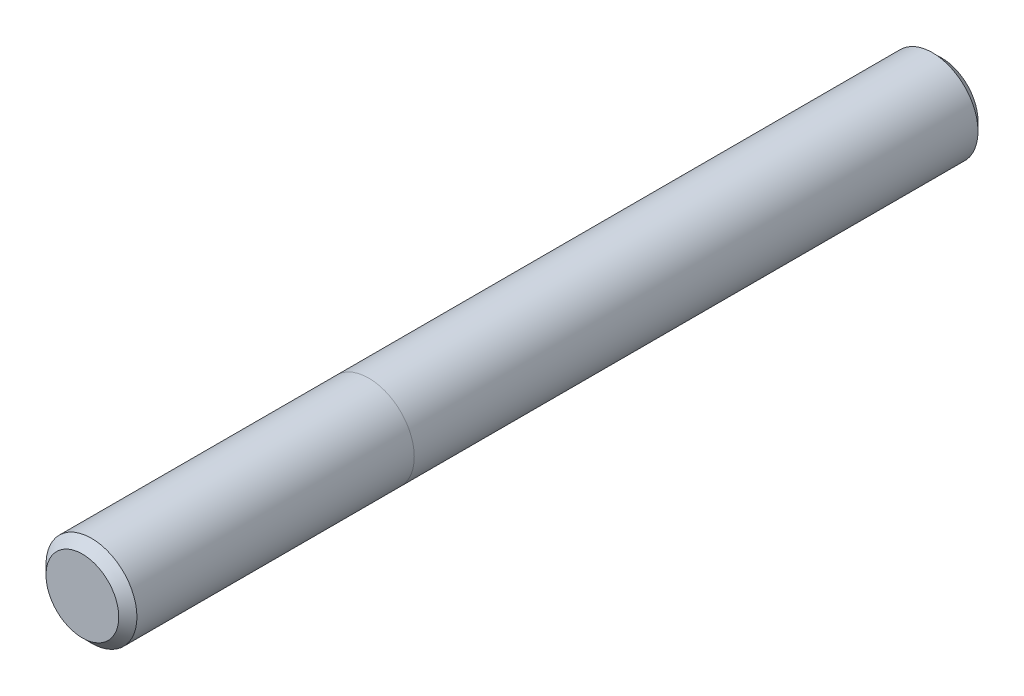
ISO-10303-21;
HEADER;
FILE_DESCRIPTION(('STEP AP214'),'2;1');
FILE_NAME('part.step','',(''),(''),'','','');
FILE_SCHEMA(('AUTOMOTIVE_DESIGN { 1 0 10303 214 1 1 1 1 }'));
ENDSEC;
DATA;
#1=APPLICATION_CONTEXT('core data for automotive mechanical design processes');
#2=APPLICATION_PROTOCOL_DEFINITION('international standard','automotive_design',2000,#1);
#3=PRODUCT_CONTEXT('',#1,'mechanical');
#4=PRODUCT('Part','Part','',(#3));
#5=PRODUCT_RELATED_PRODUCT_CATEGORY('part','',(#4));
#6=PRODUCT_DEFINITION_FORMATION('','',#4);
#7=PRODUCT_DEFINITION_CONTEXT('part definition',#1,'design');
#8=PRODUCT_DEFINITION('design','',#6,#7);
#9=PRODUCT_DEFINITION_SHAPE('','',#8);
#10=(LENGTH_UNIT() NAMED_UNIT(*) SI_UNIT(.MILLI.,.METRE.));
#11=(NAMED_UNIT(*) PLANE_ANGLE_UNIT() SI_UNIT($,.RADIAN.));
#12=(NAMED_UNIT(*) SI_UNIT($,.STERADIAN.) SOLID_ANGLE_UNIT());
#13=UNCERTAINTY_MEASURE_WITH_UNIT(LENGTH_MEASURE(1.E-05),#10,'distance_accuracy_value','');
#14=(GEOMETRIC_REPRESENTATION_CONTEXT(3) GLOBAL_UNCERTAINTY_ASSIGNED_CONTEXT((#13)) GLOBAL_UNIT_ASSIGNED_CONTEXT((#10,
#11,#12)) REPRESENTATION_CONTEXT('',''));
#15=CARTESIAN_POINT('',(0.,0.,0.));
#16=DIRECTION('',(0.,0.,1.));
#17=DIRECTION('',(1.,0.,0.));
#18=AXIS2_PLACEMENT_3D('',#15,#16,#17);
#19=CARTESIAN_POINT('',(0.,0.,75.));
#20=DIRECTION('',(0.,0.,-1.));
#21=DIRECTION('',(-1.,0.,0.));
#22=AXIS2_PLACEMENT_3D('',#19,#20,#21);
#23=CYLINDRICAL_SURFACE('',#22,7.9375);
#24=CARTESIAN_POINT('',(0.,0.,73.4125));
#25=DIRECTION('',(0.,0.,1.));
#26=DIRECTION('',(1.,0.,0.));
#27=AXIS2_PLACEMENT_3D('',#24,#25,#26);
#28=CIRCLE('',#27,7.9375);
#29=CARTESIAN_POINT('',(7.9375,0.,73.4125));
#30=VERTEX_POINT('',#29);
#31=EDGE_CURVE('E83',#30,#30,#28,.F.);
#32=ORIENTED_EDGE('',*,*,#31,.T.);
#33=EDGE_LOOP('',(#32));
#34=FACE_BOUND('',#33,.T.);
#35=CARTESIAN_POINT('',(0.,0.,25.));
#36=DIRECTION('',(0.,0.,-1.));
#37=DIRECTION('',(-1.,0.,0.));
#38=AXIS2_PLACEMENT_3D('',#35,#36,#37);
#39=CIRCLE('',#38,7.9375);
#40=CARTESIAN_POINT('',(-7.9375,0.,25.));
#41=VERTEX_POINT('',#40);
#42=CARTESIAN_POINT('',(7.9375,0.,25.));
#43=VERTEX_POINT('',#42);
#44=EDGE_CURVE('E11',#41,#43,#39,.T.);
#45=ORIENTED_EDGE('',*,*,#44,.F.);
#46=EDGE_CURVE('E53',#43,#41,#39,.T.);
#47=ORIENTED_EDGE('',*,*,#46,.F.);
#48=EDGE_LOOP('',(#45,#47));
#49=FACE_BOUND('',#48,.T.);
#50=ADVANCED_FACE('F49',(#34,#49),#23,.T.);
#51=ORIENTED_EDGE('',*,*,#46,.T.);
#52=ORIENTED_EDGE('',*,*,#44,.T.);
#53=EDGE_LOOP('',(#51,#52));
#54=FACE_BOUND('',#53,.T.);
#55=CARTESIAN_POINT('',(0.,0.,-73.4125));
#56=DIRECTION('',(0.,0.,1.));
#57=DIRECTION('',(1.,0.,0.));
#58=AXIS2_PLACEMENT_3D('',#55,#56,#57);
#59=CIRCLE('',#58,7.9375);
#60=CARTESIAN_POINT('',(7.9375,0.,-73.4125));
#61=VERTEX_POINT('',#60);
#62=EDGE_CURVE('E77',#61,#61,#59,.T.);
#63=ORIENTED_EDGE('',*,*,#62,.T.);
#64=EDGE_LOOP('',(#63));
#65=FACE_BOUND('',#64,.T.);
#66=ADVANCED_FACE('F65',(#54,#65),#23,.T.);
#67=CARTESIAN_POINT('',(0.,0.,75.));
#68=DIRECTION('',(0.,0.,1.));
#69=DIRECTION('',(1.,0.,0.));
#70=AXIS2_PLACEMENT_3D('',#67,#68,#69);
#71=PLANE('',#70);
#72=CARTESIAN_POINT('',(0.,0.,75.));
#73=DIRECTION('',(0.,0.,1.));
#74=DIRECTION('',(1.,0.,0.));
#75=AXIS2_PLACEMENT_3D('',#72,#73,#74);
#76=CIRCLE('',#75,6.34999999999997);
#77=CARTESIAN_POINT('',(6.34999999999997,0.,75.));
#78=VERTEX_POINT('',#77);
#79=EDGE_CURVE('E68',#78,#78,#76,.T.);
#80=ORIENTED_EDGE('',*,*,#79,.T.);
#81=EDGE_LOOP('',(#80));
#82=FACE_BOUND('',#81,.T.);
#83=ADVANCED_FACE('F102',(#82),#71,.T.);
#84=CARTESIAN_POINT('',(0.,0.,-75.));
#85=DIRECTION('',(0.,0.,1.));
#86=DIRECTION('',(1.,0.,0.));
#87=AXIS2_PLACEMENT_3D('',#84,#85,#86);
#88=PLANE('',#87);
#89=CARTESIAN_POINT('',(0.,0.,-75.));
#90=DIRECTION('',(0.,0.,1.));
#91=DIRECTION('',(1.,0.,0.));
#92=AXIS2_PLACEMENT_3D('',#89,#90,#91);
#93=CIRCLE('',#92,6.35000000000001);
#94=CARTESIAN_POINT('',(6.35000000000001,0.,-75.));
#95=VERTEX_POINT('',#94);
#96=EDGE_CURVE('E72',#95,#95,#93,.F.);
#97=ORIENTED_EDGE('',*,*,#96,.T.);
#98=EDGE_LOOP('',(#97));
#99=FACE_BOUND('',#98,.T.);
#100=ADVANCED_FACE('F96',(#99),#88,.F.);
#101=CARTESIAN_POINT('',(0.,0.,-73.4125));
#102=DIRECTION('',(0.,0.,1.));
#103=DIRECTION('',(1.,0.,0.));
#104=AXIS2_PLACEMENT_3D('',#101,#102,#103);
#105=CONICAL_SURFACE('',#104,7.9375,0.785398163397448);
#106=ORIENTED_EDGE('',*,*,#96,.F.);
#107=EDGE_LOOP('',(#106));
#108=FACE_BOUND('',#107,.T.);
#109=ORIENTED_EDGE('',*,*,#62,.F.);
#110=EDGE_LOOP('',(#109));
#111=FACE_BOUND('',#110,.T.);
#112=ADVANCED_FACE('F91',(#108,#111),#105,.T.);
#113=CARTESIAN_POINT('',(0.,0.,75.));
#114=DIRECTION('',(0.,0.,-1.));
#115=DIRECTION('',(-1.,0.,0.));
#116=AXIS2_PLACEMENT_3D('',#113,#114,#115);
#117=CONICAL_SURFACE('',#116,6.34999999999997,0.785398163397448);
#118=ORIENTED_EDGE('',*,*,#31,.F.);
#119=EDGE_LOOP('',(#118));
#120=FACE_BOUND('',#119,.T.);
#121=ORIENTED_EDGE('',*,*,#79,.F.);
#122=EDGE_LOOP('',(#121));
#123=FACE_BOUND('',#122,.T.);
#124=ADVANCED_FACE('F51',(#120,#123),#117,.T.);
#125=CLOSED_SHELL('',(#50,#66,#83,#100,#112,#124));
#126=MANIFOLD_SOLID_BREP('B2',#125);
#127=ADVANCED_BREP_SHAPE_REPRESENTATION('',(#18,#126),#14);
#128=SHAPE_DEFINITION_REPRESENTATION(#9,#127);
ENDSEC;
END-ISO-10303-21;
